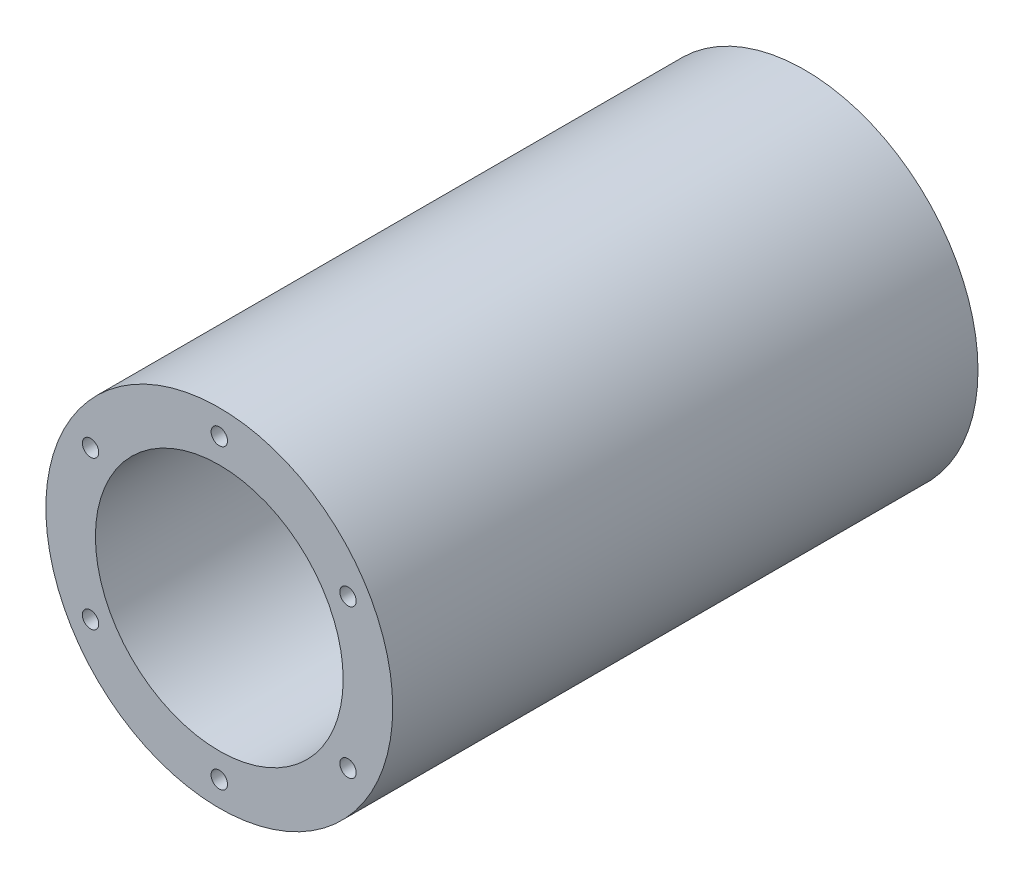
ISO-10303-21;
HEADER;
FILE_DESCRIPTION(('STEP AP214'),'2;1');
FILE_NAME('part.step','',(''),(''),'','','');
FILE_SCHEMA(('AUTOMOTIVE_DESIGN { 1 0 10303 214 1 1 1 1 }'));
ENDSEC;
DATA;
#1=APPLICATION_CONTEXT('core data for automotive mechanical design processes');
#2=APPLICATION_PROTOCOL_DEFINITION('international standard','automotive_design',2000,#1);
#3=PRODUCT_CONTEXT('',#1,'mechanical');
#4=PRODUCT('Part','Part','',(#3));
#5=PRODUCT_RELATED_PRODUCT_CATEGORY('part','',(#4));
#6=PRODUCT_DEFINITION_FORMATION('','',#4);
#7=PRODUCT_DEFINITION_CONTEXT('part definition',#1,'design');
#8=PRODUCT_DEFINITION('design','',#6,#7);
#9=PRODUCT_DEFINITION_SHAPE('','',#8);
#10=(LENGTH_UNIT() NAMED_UNIT(*) SI_UNIT(.MILLI.,.METRE.));
#11=(NAMED_UNIT(*) PLANE_ANGLE_UNIT() SI_UNIT($,.RADIAN.));
#12=(NAMED_UNIT(*) SI_UNIT($,.STERADIAN.) SOLID_ANGLE_UNIT());
#13=UNCERTAINTY_MEASURE_WITH_UNIT(LENGTH_MEASURE(1.E-05),#10,'distance_accuracy_value','');
#14=(GEOMETRIC_REPRESENTATION_CONTEXT(3) GLOBAL_UNCERTAINTY_ASSIGNED_CONTEXT((#13)) GLOBAL_UNIT_ASSIGNED_CONTEXT((#10,
#11,#12)) REPRESENTATION_CONTEXT('',''));
#15=CARTESIAN_POINT('',(0.,0.,0.));
#16=DIRECTION('',(0.,0.,1.));
#17=DIRECTION('',(1.,0.,0.));
#18=AXIS2_PLACEMENT_3D('',#15,#16,#17);
#19=CARTESIAN_POINT('',(0.,0.,75.));
#20=DIRECTION('',(0.,0.,1.));
#21=DIRECTION('',(1.,0.,0.));
#22=AXIS2_PLACEMENT_3D('',#19,#20,#21);
#23=PLANE('',#22);
#24=CARTESIAN_POINT('',(-32.9955678841869,19.0500000000004,75.));
#25=DIRECTION('',(0.,0.,1.));
#26=DIRECTION('',(1.,0.,0.));
#27=AXIS2_PLACEMENT_3D('',#24,#25,#26);
#28=CIRCLE('',#27,2.1);
#29=CARTESIAN_POINT('',(-30.8955678841869,19.0500000000004,75.));
#30=VERTEX_POINT('',#29);
#31=EDGE_CURVE('E147',#30,#30,#28,.T.);
#32=ORIENTED_EDGE('',*,*,#31,.F.);
#33=EDGE_LOOP('',(#32));
#34=FACE_BOUND('',#33,.T.);
#35=CARTESIAN_POINT('',(-32.9955678841873,-19.0499999999997,75.));
#36=DIRECTION('',(0.,0.,1.));
#37=DIRECTION('',(1.,0.,0.));
#38=AXIS2_PLACEMENT_3D('',#35,#36,#37);
#39=CIRCLE('',#38,2.1);
#40=CARTESIAN_POINT('',(-30.8955678841873,-19.0499999999997,75.));
#41=VERTEX_POINT('',#40);
#42=EDGE_CURVE('E155',#41,#41,#39,.T.);
#43=ORIENTED_EDGE('',*,*,#42,.F.);
#44=EDGE_LOOP('',(#43));
#45=FACE_BOUND('',#44,.T.);
#46=CARTESIAN_POINT('',(0.,-38.1,75.));
#47=DIRECTION('',(0.,0.,1.));
#48=DIRECTION('',(1.,0.,0.));
#49=AXIS2_PLACEMENT_3D('',#46,#47,#48);
#50=CIRCLE('',#49,2.1);
#51=CARTESIAN_POINT('',(2.1,-38.1,75.));
#52=VERTEX_POINT('',#51);
#53=EDGE_CURVE('E163',#52,#52,#50,.T.);
#54=ORIENTED_EDGE('',*,*,#53,.F.);
#55=EDGE_LOOP('',(#54));
#56=FACE_BOUND('',#55,.T.);
#57=CARTESIAN_POINT('',(32.995567884187,-19.0500000000002,75.));
#58=DIRECTION('',(0.,0.,1.));
#59=DIRECTION('',(1.,0.,0.));
#60=AXIS2_PLACEMENT_3D('',#57,#58,#59);
#61=CIRCLE('',#60,2.1);
#62=CARTESIAN_POINT('',(35.095567884187,-19.0500000000002,75.));
#63=VERTEX_POINT('',#62);
#64=EDGE_CURVE('E171',#63,#63,#61,.T.);
#65=ORIENTED_EDGE('',*,*,#64,.F.);
#66=EDGE_LOOP('',(#65));
#67=FACE_BOUND('',#66,.T.);
#68=CARTESIAN_POINT('',(32.9955678841872,19.0499999999999,75.));
#69=DIRECTION('',(0.,0.,1.));
#70=DIRECTION('',(1.,0.,0.));
#71=AXIS2_PLACEMENT_3D('',#68,#69,#70);
#72=CIRCLE('',#71,2.1);
#73=CARTESIAN_POINT('',(35.0955678841871,19.0499999999999,75.));
#74=VERTEX_POINT('',#73);
#75=EDGE_CURVE('E179',#74,#74,#72,.T.);
#76=ORIENTED_EDGE('',*,*,#75,.F.);
#77=EDGE_LOOP('',(#76));
#78=FACE_BOUND('',#77,.T.);
#79=CARTESIAN_POINT('',(0.,38.1,75.));
#80=DIRECTION('',(0.,0.,1.));
#81=DIRECTION('',(1.,0.,0.));
#82=AXIS2_PLACEMENT_3D('',#79,#80,#81);
#83=CIRCLE('',#82,2.1);
#84=CARTESIAN_POINT('',(2.1,38.1,75.));
#85=VERTEX_POINT('',#84);
#86=EDGE_CURVE('E187',#85,#85,#83,.T.);
#87=ORIENTED_EDGE('',*,*,#86,.F.);
#88=EDGE_LOOP('',(#87));
#89=FACE_BOUND('',#88,.T.);
#90=CARTESIAN_POINT('',(0.,0.,75.));
#91=DIRECTION('',(0.,0.,1.));
#92=DIRECTION('',(1.,0.,0.));
#93=AXIS2_PLACEMENT_3D('',#90,#91,#92);
#94=CIRCLE('',#93,44.45);
#95=CARTESIAN_POINT('',(44.45,0.,75.));
#96=VERTEX_POINT('',#95);
#97=EDGE_CURVE('E11',#96,#96,#94,.T.);
#98=ORIENTED_EDGE('',*,*,#97,.T.);
#99=EDGE_LOOP('',(#98));
#100=FACE_BOUND('',#99,.T.);
#101=CARTESIAN_POINT('',(0.,0.,75.));
#102=DIRECTION('',(0.,0.,1.));
#103=DIRECTION('',(1.,0.,0.));
#104=AXIS2_PLACEMENT_3D('',#101,#102,#103);
#105=CIRCLE('',#104,31.75);
#106=CARTESIAN_POINT('',(31.75,0.,75.));
#107=VERTEX_POINT('',#106);
#108=EDGE_CURVE('E196',#107,#107,#105,.T.);
#109=ORIENTED_EDGE('',*,*,#108,.F.);
#110=EDGE_LOOP('',(#109));
#111=FACE_BOUND('',#110,.T.);
#112=ADVANCED_FACE('F44',(#34,#45,#56,#67,#78,#89,#100,#111),#23,.T.);
#113=CARTESIAN_POINT('',(0.,0.,-75.));
#114=DIRECTION('',(0.,0.,1.));
#115=DIRECTION('',(1.,0.,0.));
#116=AXIS2_PLACEMENT_3D('',#113,#114,#115);
#117=PLANE('',#116);
#118=CARTESIAN_POINT('',(-32.9955678841869,19.0500000000004,-75.));
#119=DIRECTION('',(0.,0.,-1.));
#120=DIRECTION('',(-1.,0.,0.));
#121=AXIS2_PLACEMENT_3D('',#118,#119,#120);
#122=CIRCLE('',#121,2.1);
#123=CARTESIAN_POINT('',(-35.0955678841869,19.0500000000004,-75.));
#124=VERTEX_POINT('',#123);
#125=EDGE_CURVE('E102',#124,#124,#122,.T.);
#126=ORIENTED_EDGE('',*,*,#125,.F.);
#127=EDGE_LOOP('',(#126));
#128=FACE_BOUND('',#127,.T.);
#129=CARTESIAN_POINT('',(-32.9955678841873,-19.0499999999997,-75.));
#130=DIRECTION('',(0.,0.,-1.));
#131=DIRECTION('',(-1.,0.,0.));
#132=AXIS2_PLACEMENT_3D('',#129,#130,#131);
#133=CIRCLE('',#132,2.1);
#134=CARTESIAN_POINT('',(-35.0955678841873,-19.0499999999997,-75.));
#135=VERTEX_POINT('',#134);
#136=EDGE_CURVE('E101',#135,#135,#133,.T.);
#137=ORIENTED_EDGE('',*,*,#136,.F.);
#138=EDGE_LOOP('',(#137));
#139=FACE_BOUND('',#138,.T.);
#140=CARTESIAN_POINT('',(0.,-38.1,-75.));
#141=DIRECTION('',(0.,0.,-1.));
#142=DIRECTION('',(-1.,0.,0.));
#143=AXIS2_PLACEMENT_3D('',#140,#141,#142);
#144=CIRCLE('',#143,2.1);
#145=CARTESIAN_POINT('',(-2.1,-38.1,-75.));
#146=VERTEX_POINT('',#145);
#147=EDGE_CURVE('E115',#146,#146,#144,.T.);
#148=ORIENTED_EDGE('',*,*,#147,.F.);
#149=EDGE_LOOP('',(#148));
#150=FACE_BOUND('',#149,.T.);
#151=CARTESIAN_POINT('',(32.995567884187,-19.0500000000002,-75.));
#152=DIRECTION('',(0.,0.,-1.));
#153=DIRECTION('',(-1.,0.,0.));
#154=AXIS2_PLACEMENT_3D('',#151,#152,#153);
#155=CIRCLE('',#154,2.1);
#156=CARTESIAN_POINT('',(30.895567884187,-19.0500000000002,-75.));
#157=VERTEX_POINT('',#156);
#158=EDGE_CURVE('E123',#157,#157,#155,.T.);
#159=ORIENTED_EDGE('',*,*,#158,.F.);
#160=EDGE_LOOP('',(#159));
#161=FACE_BOUND('',#160,.T.);
#162=CARTESIAN_POINT('',(32.9955678841872,19.0499999999999,-75.));
#163=DIRECTION('',(0.,0.,-1.));
#164=DIRECTION('',(-1.,0.,0.));
#165=AXIS2_PLACEMENT_3D('',#162,#163,#164);
#166=CIRCLE('',#165,2.1);
#167=CARTESIAN_POINT('',(30.8955678841872,19.0499999999999,-75.));
#168=VERTEX_POINT('',#167);
#169=EDGE_CURVE('E131',#168,#168,#166,.T.);
#170=ORIENTED_EDGE('',*,*,#169,.F.);
#171=EDGE_LOOP('',(#170));
#172=FACE_BOUND('',#171,.T.);
#173=CARTESIAN_POINT('',(0.,38.1,-75.));
#174=DIRECTION('',(0.,0.,-1.));
#175=DIRECTION('',(-1.,0.,0.));
#176=AXIS2_PLACEMENT_3D('',#173,#174,#175);
#177=CIRCLE('',#176,2.1);
#178=CARTESIAN_POINT('',(-2.1,38.1,-75.));
#179=VERTEX_POINT('',#178);
#180=EDGE_CURVE('E139',#179,#179,#177,.T.);
#181=ORIENTED_EDGE('',*,*,#180,.F.);
#182=EDGE_LOOP('',(#181));
#183=FACE_BOUND('',#182,.T.);
#184=CARTESIAN_POINT('',(0.,0.,-75.));
#185=DIRECTION('',(0.,0.,1.));
#186=DIRECTION('',(1.,0.,0.));
#187=AXIS2_PLACEMENT_3D('',#184,#185,#186);
#188=CIRCLE('',#187,44.45);
#189=CARTESIAN_POINT('',(44.45,0.,-75.));
#190=VERTEX_POINT('',#189);
#191=EDGE_CURVE('E48',#190,#190,#188,.T.);
#192=ORIENTED_EDGE('',*,*,#191,.F.);
#193=EDGE_LOOP('',(#192));
#194=FACE_BOUND('',#193,.T.);
#195=CARTESIAN_POINT('',(0.,0.,-75.));
#196=DIRECTION('',(0.,0.,1.));
#197=DIRECTION('',(1.,0.,0.));
#198=AXIS2_PLACEMENT_3D('',#195,#196,#197);
#199=CIRCLE('',#198,31.75);
#200=CARTESIAN_POINT('',(31.75,0.,-75.));
#201=VERTEX_POINT('',#200);
#202=EDGE_CURVE('E195',#201,#201,#199,.T.);
#203=ORIENTED_EDGE('',*,*,#202,.T.);
#204=EDGE_LOOP('',(#203));
#205=FACE_BOUND('',#204,.T.);
#206=ADVANCED_FACE('F204',(#128,#139,#150,#161,#172,#183,#194,#205),#117,.F.);
#207=CARTESIAN_POINT('',(0.,0.,75.));
#208=DIRECTION('',(0.,0.,-1.));
#209=DIRECTION('',(-1.,0.,0.));
#210=AXIS2_PLACEMENT_3D('',#207,#208,#209);
#211=CYLINDRICAL_SURFACE('',#210,44.45);
#212=ORIENTED_EDGE('',*,*,#97,.F.);
#213=EDGE_LOOP('',(#212));
#214=FACE_BOUND('',#213,.T.);
#215=ORIENTED_EDGE('',*,*,#191,.T.);
#216=EDGE_LOOP('',(#215));
#217=FACE_BOUND('',#216,.T.);
#218=ADVANCED_FACE('F46',(#214,#217),#211,.T.);
#219=CARTESIAN_POINT('',(0.,0.,75.));
#220=DIRECTION('',(0.,0.,-1.));
#221=DIRECTION('',(-1.,0.,0.));
#222=AXIS2_PLACEMENT_3D('',#219,#220,#221);
#223=CYLINDRICAL_SURFACE('',#222,31.75);
#224=ORIENTED_EDGE('',*,*,#108,.T.);
#225=EDGE_LOOP('',(#224));
#226=FACE_BOUND('',#225,.T.);
#227=ORIENTED_EDGE('',*,*,#202,.F.);
#228=EDGE_LOOP('',(#227));
#229=FACE_BOUND('',#228,.T.);
#230=ADVANCED_FACE('F206',(#226,#229),#223,.F.);
#231=CARTESIAN_POINT('',(0.,38.1,62.6));
#232=DIRECTION('',(0.,0.,1.));
#233=DIRECTION('',(1.,0.,0.));
#234=AXIS2_PLACEMENT_3D('',#231,#232,#233);
#235=CONICAL_SURFACE('',#234,2.1,1.02974425867666);
#236=CARTESIAN_POINT('',(0.,38.1,61.3381927000421));
#237=VERTEX_POINT('',#236);
#238=VERTEX_LOOP('',#237);
#239=FACE_BOUND('',#238,.T.);
#240=CARTESIAN_POINT('',(0.,38.1,62.6));
#241=DIRECTION('',(0.,0.,1.));
#242=DIRECTION('',(1.,0.,0.));
#243=AXIS2_PLACEMENT_3D('',#240,#241,#242);
#244=CIRCLE('',#243,2.1);
#245=CARTESIAN_POINT('',(2.1,38.1,62.6));
#246=VERTEX_POINT('',#245);
#247=EDGE_CURVE('E191',#246,#246,#244,.T.);
#248=ORIENTED_EDGE('',*,*,#247,.T.);
#249=EDGE_LOOP('',(#248));
#250=FACE_BOUND('',#249,.T.);
#251=ADVANCED_FACE('F208',(#239,#250),#235,.F.);
#252=CARTESIAN_POINT('',(0.,38.1,75.));
#253=DIRECTION('',(0.,0.,1.));
#254=DIRECTION('',(1.,0.,0.));
#255=AXIS2_PLACEMENT_3D('',#252,#253,#254);
#256=CYLINDRICAL_SURFACE('',#255,2.1);
#257=ORIENTED_EDGE('',*,*,#247,.F.);
#258=EDGE_LOOP('',(#257));
#259=FACE_BOUND('',#258,.T.);
#260=ORIENTED_EDGE('',*,*,#86,.T.);
#261=EDGE_LOOP('',(#260));
#262=FACE_BOUND('',#261,.T.);
#263=ADVANCED_FACE('F215',(#259,#262),#256,.F.);
#264=CARTESIAN_POINT('',(32.9955678841872,19.0499999999999,62.6));
#265=DIRECTION('',(0.,0.,1.));
#266=DIRECTION('',(1.,0.,0.));
#267=AXIS2_PLACEMENT_3D('',#264,#265,#266);
#268=CONICAL_SURFACE('',#267,2.1,1.02974425867666);
#269=CARTESIAN_POINT('',(32.9955678841872,19.0499999999999,61.3381927000421));
#270=VERTEX_POINT('',#269);
#271=VERTEX_LOOP('',#270);
#272=FACE_BOUND('',#271,.T.);
#273=CARTESIAN_POINT('',(32.9955678841872,19.0499999999999,62.6));
#274=DIRECTION('',(0.,0.,1.));
#275=DIRECTION('',(1.,0.,0.));
#276=AXIS2_PLACEMENT_3D('',#273,#274,#275);
#277=CIRCLE('',#276,2.1);
#278=CARTESIAN_POINT('',(35.0955678841871,19.0499999999999,62.6));
#279=VERTEX_POINT('',#278);
#280=EDGE_CURVE('E183',#279,#279,#277,.T.);
#281=ORIENTED_EDGE('',*,*,#280,.T.);
#282=EDGE_LOOP('',(#281));
#283=FACE_BOUND('',#282,.T.);
#284=ADVANCED_FACE('F247',(#272,#283),#268,.F.);
#285=CARTESIAN_POINT('',(32.9955678841872,19.0499999999999,75.));
#286=DIRECTION('',(0.,0.,1.));
#287=DIRECTION('',(1.,0.,0.));
#288=AXIS2_PLACEMENT_3D('',#285,#286,#287);
#289=CYLINDRICAL_SURFACE('',#288,2.1);
#290=ORIENTED_EDGE('',*,*,#280,.F.);
#291=EDGE_LOOP('',(#290));
#292=FACE_BOUND('',#291,.T.);
#293=ORIENTED_EDGE('',*,*,#75,.T.);
#294=EDGE_LOOP('',(#293));
#295=FACE_BOUND('',#294,.T.);
#296=ADVANCED_FACE('F253',(#292,#295),#289,.F.);
#297=CARTESIAN_POINT('',(32.995567884187,-19.0500000000002,62.6));
#298=DIRECTION('',(0.,0.,1.));
#299=DIRECTION('',(1.,0.,0.));
#300=AXIS2_PLACEMENT_3D('',#297,#298,#299);
#301=CONICAL_SURFACE('',#300,2.1,1.02974425867666);
#302=CARTESIAN_POINT('',(32.995567884187,-19.0500000000002,61.3381927000421));
#303=VERTEX_POINT('',#302);
#304=VERTEX_LOOP('',#303);
#305=FACE_BOUND('',#304,.T.);
#306=CARTESIAN_POINT('',(32.995567884187,-19.0500000000002,62.6));
#307=DIRECTION('',(0.,0.,1.));
#308=DIRECTION('',(1.,0.,0.));
#309=AXIS2_PLACEMENT_3D('',#306,#307,#308);
#310=CIRCLE('',#309,2.1);
#311=CARTESIAN_POINT('',(35.095567884187,-19.0500000000002,62.6));
#312=VERTEX_POINT('',#311);
#313=EDGE_CURVE('E175',#312,#312,#310,.T.);
#314=ORIENTED_EDGE('',*,*,#313,.T.);
#315=EDGE_LOOP('',(#314));
#316=FACE_BOUND('',#315,.T.);
#317=ADVANCED_FACE('F259',(#305,#316),#301,.F.);
#318=CARTESIAN_POINT('',(32.995567884187,-19.0500000000002,75.));
#319=DIRECTION('',(0.,0.,1.));
#320=DIRECTION('',(1.,0.,0.));
#321=AXIS2_PLACEMENT_3D('',#318,#319,#320);
#322=CYLINDRICAL_SURFACE('',#321,2.1);
#323=ORIENTED_EDGE('',*,*,#313,.F.);
#324=EDGE_LOOP('',(#323));
#325=FACE_BOUND('',#324,.T.);
#326=ORIENTED_EDGE('',*,*,#64,.T.);
#327=EDGE_LOOP('',(#326));
#328=FACE_BOUND('',#327,.T.);
#329=ADVANCED_FACE('F263',(#325,#328),#322,.F.);
#330=CARTESIAN_POINT('',(0.,-38.1,62.6));
#331=DIRECTION('',(0.,0.,1.));
#332=DIRECTION('',(1.,0.,0.));
#333=AXIS2_PLACEMENT_3D('',#330,#331,#332);
#334=CONICAL_SURFACE('',#333,2.1,1.02974425867666);
#335=CARTESIAN_POINT('',(0.,-38.1,61.3381927000421));
#336=VERTEX_POINT('',#335);
#337=VERTEX_LOOP('',#336);
#338=FACE_BOUND('',#337,.T.);
#339=CARTESIAN_POINT('',(0.,-38.1,62.6));
#340=DIRECTION('',(0.,0.,1.));
#341=DIRECTION('',(1.,0.,0.));
#342=AXIS2_PLACEMENT_3D('',#339,#340,#341);
#343=CIRCLE('',#342,2.1);
#344=CARTESIAN_POINT('',(2.1,-38.1,62.6));
#345=VERTEX_POINT('',#344);
#346=EDGE_CURVE('E167',#345,#345,#343,.T.);
#347=ORIENTED_EDGE('',*,*,#346,.T.);
#348=EDGE_LOOP('',(#347));
#349=FACE_BOUND('',#348,.T.);
#350=ADVANCED_FACE('F267',(#338,#349),#334,.F.);
#351=CARTESIAN_POINT('',(0.,-38.1,75.));
#352=DIRECTION('',(0.,0.,1.));
#353=DIRECTION('',(1.,0.,0.));
#354=AXIS2_PLACEMENT_3D('',#351,#352,#353);
#355=CYLINDRICAL_SURFACE('',#354,2.1);
#356=ORIENTED_EDGE('',*,*,#346,.F.);
#357=EDGE_LOOP('',(#356));
#358=FACE_BOUND('',#357,.T.);
#359=ORIENTED_EDGE('',*,*,#53,.T.);
#360=EDGE_LOOP('',(#359));
#361=FACE_BOUND('',#360,.T.);
#362=ADVANCED_FACE('F271',(#358,#361),#355,.F.);
#363=CARTESIAN_POINT('',(-32.9955678841873,-19.0499999999997,62.6));
#364=DIRECTION('',(0.,0.,1.));
#365=DIRECTION('',(1.,0.,0.));
#366=AXIS2_PLACEMENT_3D('',#363,#364,#365);
#367=CONICAL_SURFACE('',#366,2.1,1.02974425867666);
#368=CARTESIAN_POINT('',(-32.9955678841873,-19.0499999999997,61.3381927000421));
#369=VERTEX_POINT('',#368);
#370=VERTEX_LOOP('',#369);
#371=FACE_BOUND('',#370,.T.);
#372=CARTESIAN_POINT('',(-32.9955678841873,-19.0499999999997,62.6));
#373=DIRECTION('',(0.,0.,1.));
#374=DIRECTION('',(1.,0.,0.));
#375=AXIS2_PLACEMENT_3D('',#372,#373,#374);
#376=CIRCLE('',#375,2.1);
#377=CARTESIAN_POINT('',(-30.8955678841873,-19.0499999999997,62.6));
#378=VERTEX_POINT('',#377);
#379=EDGE_CURVE('E159',#378,#378,#376,.T.);
#380=ORIENTED_EDGE('',*,*,#379,.T.);
#381=EDGE_LOOP('',(#380));
#382=FACE_BOUND('',#381,.T.);
#383=ADVANCED_FACE('F275',(#371,#382),#367,.F.);
#384=CARTESIAN_POINT('',(-32.9955678841873,-19.0499999999997,75.));
#385=DIRECTION('',(0.,0.,1.));
#386=DIRECTION('',(1.,0.,0.));
#387=AXIS2_PLACEMENT_3D('',#384,#385,#386);
#388=CYLINDRICAL_SURFACE('',#387,2.1);
#389=ORIENTED_EDGE('',*,*,#379,.F.);
#390=EDGE_LOOP('',(#389));
#391=FACE_BOUND('',#390,.T.);
#392=ORIENTED_EDGE('',*,*,#42,.T.);
#393=EDGE_LOOP('',(#392));
#394=FACE_BOUND('',#393,.T.);
#395=ADVANCED_FACE('F279',(#391,#394),#388,.F.);
#396=CARTESIAN_POINT('',(-32.9955678841869,19.0500000000004,62.6));
#397=DIRECTION('',(0.,0.,1.));
#398=DIRECTION('',(1.,0.,0.));
#399=AXIS2_PLACEMENT_3D('',#396,#397,#398);
#400=CONICAL_SURFACE('',#399,2.1,1.02974425867666);
#401=CARTESIAN_POINT('',(-32.9955678841869,19.0500000000004,61.3381927000421));
#402=VERTEX_POINT('',#401);
#403=VERTEX_LOOP('',#402);
#404=FACE_BOUND('',#403,.T.);
#405=CARTESIAN_POINT('',(-32.9955678841869,19.0500000000004,62.6));
#406=DIRECTION('',(0.,0.,1.));
#407=DIRECTION('',(1.,0.,0.));
#408=AXIS2_PLACEMENT_3D('',#405,#406,#407);
#409=CIRCLE('',#408,2.1);
#410=CARTESIAN_POINT('',(-30.8955678841869,19.0500000000004,62.6));
#411=VERTEX_POINT('',#410);
#412=EDGE_CURVE('E151',#411,#411,#409,.T.);
#413=ORIENTED_EDGE('',*,*,#412,.T.);
#414=EDGE_LOOP('',(#413));
#415=FACE_BOUND('',#414,.T.);
#416=ADVANCED_FACE('F283',(#404,#415),#400,.F.);
#417=CARTESIAN_POINT('',(-32.9955678841869,19.0500000000004,75.));
#418=DIRECTION('',(0.,0.,1.));
#419=DIRECTION('',(1.,0.,0.));
#420=AXIS2_PLACEMENT_3D('',#417,#418,#419);
#421=CYLINDRICAL_SURFACE('',#420,2.1);
#422=ORIENTED_EDGE('',*,*,#412,.F.);
#423=EDGE_LOOP('',(#422));
#424=FACE_BOUND('',#423,.T.);
#425=ORIENTED_EDGE('',*,*,#31,.T.);
#426=EDGE_LOOP('',(#425));
#427=FACE_BOUND('',#426,.T.);
#428=ADVANCED_FACE('F287',(#424,#427),#421,.F.);
#429=CARTESIAN_POINT('',(0.,38.1,-62.6));
#430=DIRECTION('',(0.,0.,-1.));
#431=DIRECTION('',(-1.,0.,0.));
#432=AXIS2_PLACEMENT_3D('',#429,#430,#431);
#433=CONICAL_SURFACE('',#432,2.1,1.02974425867666);
#434=CARTESIAN_POINT('',(0.,38.1,-61.3381927000421));
#435=VERTEX_POINT('',#434);
#436=VERTEX_LOOP('',#435);
#437=FACE_BOUND('',#436,.T.);
#438=CARTESIAN_POINT('',(0.,38.1,-62.6));
#439=DIRECTION('',(0.,0.,-1.));
#440=DIRECTION('',(-1.,0.,0.));
#441=AXIS2_PLACEMENT_3D('',#438,#439,#440);
#442=CIRCLE('',#441,2.1);
#443=CARTESIAN_POINT('',(-2.1,38.1,-62.6));
#444=VERTEX_POINT('',#443);
#445=EDGE_CURVE('E143',#444,#444,#442,.T.);
#446=ORIENTED_EDGE('',*,*,#445,.T.);
#447=EDGE_LOOP('',(#446));
#448=FACE_BOUND('',#447,.T.);
#449=ADVANCED_FACE('F291',(#437,#448),#433,.F.);
#450=CARTESIAN_POINT('',(0.,38.1,-75.));
#451=DIRECTION('',(0.,0.,-1.));
#452=DIRECTION('',(-1.,0.,0.));
#453=AXIS2_PLACEMENT_3D('',#450,#451,#452);
#454=CYLINDRICAL_SURFACE('',#453,2.1);
#455=ORIENTED_EDGE('',*,*,#445,.F.);
#456=EDGE_LOOP('',(#455));
#457=FACE_BOUND('',#456,.T.);
#458=ORIENTED_EDGE('',*,*,#180,.T.);
#459=EDGE_LOOP('',(#458));
#460=FACE_BOUND('',#459,.T.);
#461=ADVANCED_FACE('F295',(#457,#460),#454,.F.);
#462=CARTESIAN_POINT('',(32.9955678841872,19.0499999999999,-62.6));
#463=DIRECTION('',(0.,0.,-1.));
#464=DIRECTION('',(-1.,0.,0.));
#465=AXIS2_PLACEMENT_3D('',#462,#463,#464);
#466=CONICAL_SURFACE('',#465,2.1,1.02974425867666);
#467=CARTESIAN_POINT('',(32.9955678841872,19.0499999999999,-61.3381927000421));
#468=VERTEX_POINT('',#467);
#469=VERTEX_LOOP('',#468);
#470=FACE_BOUND('',#469,.T.);
#471=CARTESIAN_POINT('',(32.9955678841872,19.0499999999999,-62.6));
#472=DIRECTION('',(0.,0.,-1.));
#473=DIRECTION('',(-1.,0.,0.));
#474=AXIS2_PLACEMENT_3D('',#471,#472,#473);
#475=CIRCLE('',#474,2.1);
#476=CARTESIAN_POINT('',(30.8955678841872,19.0499999999999,-62.6));
#477=VERTEX_POINT('',#476);
#478=EDGE_CURVE('E135',#477,#477,#475,.T.);
#479=ORIENTED_EDGE('',*,*,#478,.T.);
#480=EDGE_LOOP('',(#479));
#481=FACE_BOUND('',#480,.T.);
#482=ADVANCED_FACE('F299',(#470,#481),#466,.F.);
#483=CARTESIAN_POINT('',(32.9955678841872,19.0499999999999,-75.));
#484=DIRECTION('',(0.,0.,-1.));
#485=DIRECTION('',(-1.,0.,0.));
#486=AXIS2_PLACEMENT_3D('',#483,#484,#485);
#487=CYLINDRICAL_SURFACE('',#486,2.1);
#488=ORIENTED_EDGE('',*,*,#478,.F.);
#489=EDGE_LOOP('',(#488));
#490=FACE_BOUND('',#489,.T.);
#491=ORIENTED_EDGE('',*,*,#169,.T.);
#492=EDGE_LOOP('',(#491));
#493=FACE_BOUND('',#492,.T.);
#494=ADVANCED_FACE('F303',(#490,#493),#487,.F.);
#495=CARTESIAN_POINT('',(32.995567884187,-19.0500000000002,-62.6));
#496=DIRECTION('',(0.,0.,-1.));
#497=DIRECTION('',(-1.,0.,0.));
#498=AXIS2_PLACEMENT_3D('',#495,#496,#497);
#499=CONICAL_SURFACE('',#498,2.1,1.02974425867666);
#500=CARTESIAN_POINT('',(32.995567884187,-19.0500000000002,-61.3381927000421));
#501=VERTEX_POINT('',#500);
#502=VERTEX_LOOP('',#501);
#503=FACE_BOUND('',#502,.T.);
#504=CARTESIAN_POINT('',(32.995567884187,-19.0500000000002,-62.6));
#505=DIRECTION('',(0.,0.,-1.));
#506=DIRECTION('',(-1.,0.,0.));
#507=AXIS2_PLACEMENT_3D('',#504,#505,#506);
#508=CIRCLE('',#507,2.1);
#509=CARTESIAN_POINT('',(30.895567884187,-19.0500000000002,-62.6));
#510=VERTEX_POINT('',#509);
#511=EDGE_CURVE('E127',#510,#510,#508,.T.);
#512=ORIENTED_EDGE('',*,*,#511,.T.);
#513=EDGE_LOOP('',(#512));
#514=FACE_BOUND('',#513,.T.);
#515=ADVANCED_FACE('F307',(#503,#514),#499,.F.);
#516=CARTESIAN_POINT('',(32.995567884187,-19.0500000000002,-75.));
#517=DIRECTION('',(0.,0.,-1.));
#518=DIRECTION('',(-1.,0.,0.));
#519=AXIS2_PLACEMENT_3D('',#516,#517,#518);
#520=CYLINDRICAL_SURFACE('',#519,2.1);
#521=ORIENTED_EDGE('',*,*,#511,.F.);
#522=EDGE_LOOP('',(#521));
#523=FACE_BOUND('',#522,.T.);
#524=ORIENTED_EDGE('',*,*,#158,.T.);
#525=EDGE_LOOP('',(#524));
#526=FACE_BOUND('',#525,.T.);
#527=ADVANCED_FACE('F311',(#523,#526),#520,.F.);
#528=CARTESIAN_POINT('',(0.,-38.1,-62.6));
#529=DIRECTION('',(0.,0.,-1.));
#530=DIRECTION('',(-1.,0.,0.));
#531=AXIS2_PLACEMENT_3D('',#528,#529,#530);
#532=CONICAL_SURFACE('',#531,2.1,1.02974425867666);
#533=CARTESIAN_POINT('',(0.,-38.1,-61.3381927000421));
#534=VERTEX_POINT('',#533);
#535=VERTEX_LOOP('',#534);
#536=FACE_BOUND('',#535,.T.);
#537=CARTESIAN_POINT('',(0.,-38.1,-62.6));
#538=DIRECTION('',(0.,0.,-1.));
#539=DIRECTION('',(-1.,0.,0.));
#540=AXIS2_PLACEMENT_3D('',#537,#538,#539);
#541=CIRCLE('',#540,2.1);
#542=CARTESIAN_POINT('',(-2.1,-38.1,-62.6));
#543=VERTEX_POINT('',#542);
#544=EDGE_CURVE('E119',#543,#543,#541,.T.);
#545=ORIENTED_EDGE('',*,*,#544,.T.);
#546=EDGE_LOOP('',(#545));
#547=FACE_BOUND('',#546,.T.);
#548=ADVANCED_FACE('F315',(#536,#547),#532,.F.);
#549=CARTESIAN_POINT('',(0.,-38.1,-75.));
#550=DIRECTION('',(0.,0.,-1.));
#551=DIRECTION('',(-1.,0.,0.));
#552=AXIS2_PLACEMENT_3D('',#549,#550,#551);
#553=CYLINDRICAL_SURFACE('',#552,2.1);
#554=ORIENTED_EDGE('',*,*,#544,.F.);
#555=EDGE_LOOP('',(#554));
#556=FACE_BOUND('',#555,.T.);
#557=ORIENTED_EDGE('',*,*,#147,.T.);
#558=EDGE_LOOP('',(#557));
#559=FACE_BOUND('',#558,.T.);
#560=ADVANCED_FACE('F319',(#556,#559),#553,.F.);
#561=CARTESIAN_POINT('',(-32.9955678841873,-19.0499999999997,-62.6));
#562=DIRECTION('',(0.,0.,-1.));
#563=DIRECTION('',(-1.,0.,0.));
#564=AXIS2_PLACEMENT_3D('',#561,#562,#563);
#565=CONICAL_SURFACE('',#564,2.1,1.02974425867666);
#566=CARTESIAN_POINT('',(-32.9955678841873,-19.0499999999997,-61.3381927000421));
#567=VERTEX_POINT('',#566);
#568=VERTEX_LOOP('',#567);
#569=FACE_BOUND('',#568,.T.);
#570=CARTESIAN_POINT('',(-32.9955678841873,-19.0499999999997,-62.6));
#571=DIRECTION('',(0.,0.,-1.));
#572=DIRECTION('',(-1.,0.,0.));
#573=AXIS2_PLACEMENT_3D('',#570,#571,#572);
#574=CIRCLE('',#573,2.1);
#575=CARTESIAN_POINT('',(-35.0955678841873,-19.0499999999997,-62.6));
#576=VERTEX_POINT('',#575);
#577=EDGE_CURVE('E107',#576,#576,#574,.T.);
#578=ORIENTED_EDGE('',*,*,#577,.T.);
#579=EDGE_LOOP('',(#578));
#580=FACE_BOUND('',#579,.T.);
#581=ADVANCED_FACE('F323',(#569,#580),#565,.F.);
#582=CARTESIAN_POINT('',(-32.9955678841873,-19.0499999999997,-75.));
#583=DIRECTION('',(0.,0.,-1.));
#584=DIRECTION('',(-1.,0.,0.));
#585=AXIS2_PLACEMENT_3D('',#582,#583,#584);
#586=CYLINDRICAL_SURFACE('',#585,2.1);
#587=ORIENTED_EDGE('',*,*,#577,.F.);
#588=EDGE_LOOP('',(#587));
#589=FACE_BOUND('',#588,.T.);
#590=ORIENTED_EDGE('',*,*,#136,.T.);
#591=EDGE_LOOP('',(#590));
#592=FACE_BOUND('',#591,.T.);
#593=ADVANCED_FACE('F94',(#589,#592),#586,.F.);
#594=CARTESIAN_POINT('',(-32.9955678841869,19.0500000000004,-62.6));
#595=DIRECTION('',(0.,0.,-1.));
#596=DIRECTION('',(-1.,0.,0.));
#597=AXIS2_PLACEMENT_3D('',#594,#595,#596);
#598=CONICAL_SURFACE('',#597,2.1,1.02974425867666);
#599=CARTESIAN_POINT('',(-32.9955678841869,19.0500000000004,-61.3381927000421));
#600=VERTEX_POINT('',#599);
#601=VERTEX_LOOP('',#600);
#602=FACE_BOUND('',#601,.T.);
#603=CARTESIAN_POINT('',(-32.9955678841869,19.0500000000004,-62.6));
#604=DIRECTION('',(0.,0.,-1.));
#605=DIRECTION('',(-1.,0.,0.));
#606=AXIS2_PLACEMENT_3D('',#603,#604,#605);
#607=CIRCLE('',#606,2.1);
#608=CARTESIAN_POINT('',(-35.0955678841869,19.0500000000004,-62.6));
#609=VERTEX_POINT('',#608);
#610=EDGE_CURVE('E98',#609,#609,#607,.T.);
#611=ORIENTED_EDGE('',*,*,#610,.T.);
#612=EDGE_LOOP('',(#611));
#613=FACE_BOUND('',#612,.T.);
#614=ADVANCED_FACE('F90',(#602,#613),#598,.F.);
#615=CARTESIAN_POINT('',(-32.9955678841869,19.0500000000004,-75.));
#616=DIRECTION('',(0.,0.,-1.));
#617=DIRECTION('',(-1.,0.,0.));
#618=AXIS2_PLACEMENT_3D('',#615,#616,#617);
#619=CYLINDRICAL_SURFACE('',#618,2.1);
#620=ORIENTED_EDGE('',*,*,#610,.F.);
#621=EDGE_LOOP('',(#620));
#622=FACE_BOUND('',#621,.T.);
#623=ORIENTED_EDGE('',*,*,#125,.T.);
#624=EDGE_LOOP('',(#623));
#625=FACE_BOUND('',#624,.T.);
#626=ADVANCED_FACE('F93',(#622,#625),#619,.F.);
#627=CLOSED_SHELL('',(#112,#206,#218,#230,#251,#263,#284,#296,#317,#329,#350,#362,#383,#395,
#416,#428,#449,#461,#482,#494,#515,#527,#548,#560,#581,#593,#614,#626));
#628=MANIFOLD_SOLID_BREP('B2',#627);
#629=ADVANCED_BREP_SHAPE_REPRESENTATION('',(#18,#628),#14);
#630=SHAPE_DEFINITION_REPRESENTATION(#9,#629);
ENDSEC;
END-ISO-10303-21;
